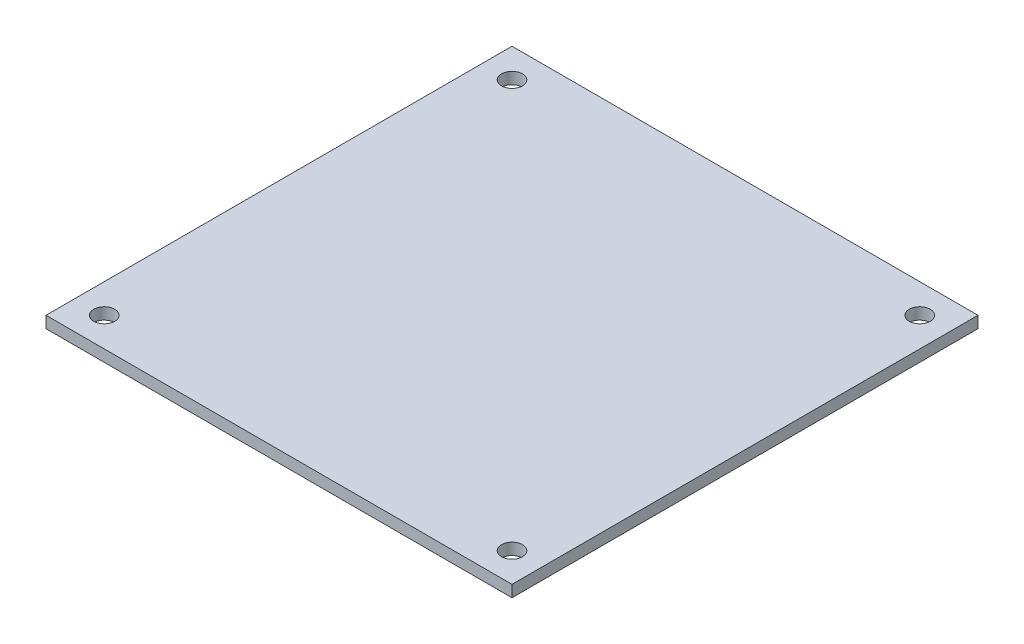
ISO-10303-21;
HEADER;
FILE_DESCRIPTION(('STEP AP214'),'2;1');
FILE_NAME('part.step','',(''),(''),'','','');
FILE_SCHEMA(('AUTOMOTIVE_DESIGN { 1 0 10303 214 1 1 1 1 }'));
ENDSEC;
DATA;
#1=APPLICATION_CONTEXT('core data for automotive mechanical design processes');
#2=APPLICATION_PROTOCOL_DEFINITION('international standard','automotive_design',2000,#1);
#3=PRODUCT_CONTEXT('',#1,'mechanical');
#4=PRODUCT('Part','Part','',(#3));
#5=PRODUCT_RELATED_PRODUCT_CATEGORY('part','',(#4));
#6=PRODUCT_DEFINITION_FORMATION('','',#4);
#7=PRODUCT_DEFINITION_CONTEXT('part definition',#1,'design');
#8=PRODUCT_DEFINITION('design','',#6,#7);
#9=PRODUCT_DEFINITION_SHAPE('','',#8);
#10=(LENGTH_UNIT() NAMED_UNIT(*) SI_UNIT(.MILLI.,.METRE.));
#11=(NAMED_UNIT(*) PLANE_ANGLE_UNIT() SI_UNIT($,.RADIAN.));
#12=(NAMED_UNIT(*) SI_UNIT($,.STERADIAN.) SOLID_ANGLE_UNIT());
#13=UNCERTAINTY_MEASURE_WITH_UNIT(LENGTH_MEASURE(1.E-05),#10,'distance_accuracy_value','');
#14=(GEOMETRIC_REPRESENTATION_CONTEXT(3) GLOBAL_UNCERTAINTY_ASSIGNED_CONTEXT((#13)) GLOBAL_UNIT_ASSIGNED_CONTEXT((#10,
#11,#12)) REPRESENTATION_CONTEXT('',''));
#15=CARTESIAN_POINT('',(0.,0.,0.));
#16=DIRECTION('',(0.,0.,1.));
#17=DIRECTION('',(1.,0.,0.));
#18=AXIS2_PLACEMENT_3D('',#15,#16,#17);
#19=CARTESIAN_POINT('',(0.,2.,0.));
#20=DIRECTION('',(1.,0.,0.));
#21=DIRECTION('',(0.,0.,-1.));
#22=AXIS2_PLACEMENT_3D('',#19,#20,#21);
#23=PLANE('',#22);
#24=DIRECTION('',(0.,0.,1.));
#25=VECTOR('',#24,1.);
#26=CARTESIAN_POINT('',(0.,0.,0.));
#27=LINE('',#26,#25);
#28=CARTESIAN_POINT('',(0.,0.,-80.));
#29=VERTEX_POINT('',#28);
#30=CARTESIAN_POINT('',(0.,0.,0.));
#31=VERTEX_POINT('',#30);
#32=EDGE_CURVE('E102',#29,#31,#27,.T.);
#33=ORIENTED_EDGE('',*,*,#32,.T.);
#34=DIRECTION('',(0.,-1.,0.));
#35=VECTOR('',#34,1.);
#36=CARTESIAN_POINT('',(0.,2.,0.));
#37=LINE('',#36,#35);
#38=CARTESIAN_POINT('',(0.,2.,0.));
#39=VERTEX_POINT('',#38);
#40=EDGE_CURVE('E93',#39,#31,#37,.T.);
#41=ORIENTED_EDGE('',*,*,#40,.F.);
#42=DIRECTION('',(0.,0.,1.));
#43=VECTOR('',#42,1.);
#44=CARTESIAN_POINT('',(0.,2.,0.));
#45=LINE('',#44,#43);
#46=CARTESIAN_POINT('',(0.,2.,-80.));
#47=VERTEX_POINT('',#46);
#48=EDGE_CURVE('E87',#47,#39,#45,.T.);
#49=ORIENTED_EDGE('',*,*,#48,.F.);
#50=DIRECTION('',(0.,-1.,0.));
#51=VECTOR('',#50,1.);
#52=CARTESIAN_POINT('',(0.,2.,-80.));
#53=LINE('',#52,#51);
#54=EDGE_CURVE('E98',#47,#29,#53,.T.);
#55=ORIENTED_EDGE('',*,*,#54,.T.);
#56=EDGE_LOOP('',(#33,#41,#49,#55));
#57=FACE_BOUND('',#56,.T.);
#58=ADVANCED_FACE('F33',(#57),#23,.F.);
#59=CARTESIAN_POINT('',(0.,2.,0.));
#60=DIRECTION('',(0.,0.,-1.));
#61=DIRECTION('',(-1.,0.,0.));
#62=AXIS2_PLACEMENT_3D('',#59,#60,#61);
#63=PLANE('',#62);
#64=DIRECTION('',(1.,0.,0.));
#65=VECTOR('',#64,1.);
#66=CARTESIAN_POINT('',(0.,0.,0.));
#67=LINE('',#66,#65);
#68=CARTESIAN_POINT('',(80.,0.,0.));
#69=VERTEX_POINT('',#68);
#70=EDGE_CURVE('E92',#31,#69,#67,.T.);
#71=ORIENTED_EDGE('',*,*,#70,.T.);
#72=DIRECTION('',(0.,-1.,0.));
#73=VECTOR('',#72,1.);
#74=CARTESIAN_POINT('',(80.,2.,0.));
#75=LINE('',#74,#73);
#76=CARTESIAN_POINT('',(80.,2.,0.));
#77=VERTEX_POINT('',#76);
#78=EDGE_CURVE('E90',#77,#69,#75,.T.);
#79=ORIENTED_EDGE('',*,*,#78,.F.);
#80=DIRECTION('',(1.,0.,0.));
#81=VECTOR('',#80,1.);
#82=CARTESIAN_POINT('',(0.,2.,0.));
#83=LINE('',#82,#81);
#84=EDGE_CURVE('E81',#39,#77,#83,.T.);
#85=ORIENTED_EDGE('',*,*,#84,.F.);
#86=ORIENTED_EDGE('',*,*,#40,.T.);
#87=EDGE_LOOP('',(#71,#79,#85,#86));
#88=FACE_BOUND('',#87,.T.);
#89=ADVANCED_FACE('F91',(#88),#63,.F.);
#90=CARTESIAN_POINT('',(80.,2.,0.));
#91=DIRECTION('',(-1.,0.,0.));
#92=DIRECTION('',(0.,0.,1.));
#93=AXIS2_PLACEMENT_3D('',#90,#91,#92);
#94=PLANE('',#93);
#95=DIRECTION('',(0.,0.,-1.));
#96=VECTOR('',#95,1.);
#97=CARTESIAN_POINT('',(80.,0.,0.));
#98=LINE('',#97,#96);
#99=CARTESIAN_POINT('',(80.,0.,-80.));
#100=VERTEX_POINT('',#99);
#101=EDGE_CURVE('E67',#69,#100,#98,.T.);
#102=ORIENTED_EDGE('',*,*,#101,.T.);
#103=DIRECTION('',(0.,-1.,0.));
#104=VECTOR('',#103,1.);
#105=CARTESIAN_POINT('',(80.,2.,-80.));
#106=LINE('',#105,#104);
#107=CARTESIAN_POINT('',(80.,2.,-80.));
#108=VERTEX_POINT('',#107);
#109=EDGE_CURVE('E94',#108,#100,#106,.T.);
#110=ORIENTED_EDGE('',*,*,#109,.F.);
#111=DIRECTION('',(0.,0.,-1.));
#112=VECTOR('',#111,1.);
#113=CARTESIAN_POINT('',(80.,2.,0.));
#114=LINE('',#113,#112);
#115=EDGE_CURVE('E85',#77,#108,#114,.T.);
#116=ORIENTED_EDGE('',*,*,#115,.F.);
#117=ORIENTED_EDGE('',*,*,#78,.T.);
#118=EDGE_LOOP('',(#102,#110,#116,#117));
#119=FACE_BOUND('',#118,.T.);
#120=ADVANCED_FACE('F96',(#119),#94,.F.);
#121=CARTESIAN_POINT('',(0.,2.,-80.));
#122=DIRECTION('',(0.,0.,1.));
#123=DIRECTION('',(1.,0.,0.));
#124=AXIS2_PLACEMENT_3D('',#121,#122,#123);
#125=PLANE('',#124);
#126=DIRECTION('',(-1.,0.,0.));
#127=VECTOR('',#126,1.);
#128=CARTESIAN_POINT('',(0.,0.,-80.));
#129=LINE('',#128,#127);
#130=EDGE_CURVE('E73',#100,#29,#129,.T.);
#131=ORIENTED_EDGE('',*,*,#130,.T.);
#132=ORIENTED_EDGE('',*,*,#54,.F.);
#133=DIRECTION('',(-1.,0.,0.));
#134=VECTOR('',#133,1.);
#135=CARTESIAN_POINT('',(0.,2.,-80.));
#136=LINE('',#135,#134);
#137=EDGE_CURVE('E50',#108,#47,#136,.T.);
#138=ORIENTED_EDGE('',*,*,#137,.F.);
#139=ORIENTED_EDGE('',*,*,#109,.T.);
#140=EDGE_LOOP('',(#131,#132,#138,#139));
#141=FACE_BOUND('',#140,.T.);
#142=ADVANCED_FACE('F128',(#141),#125,.F.);
#143=CARTESIAN_POINT('',(0.,2.,0.));
#144=DIRECTION('',(0.,-1.,0.));
#145=DIRECTION('',(0.,0.,-1.));
#146=AXIS2_PLACEMENT_3D('',#143,#144,#145);
#147=PLANE('',#146);
#148=CARTESIAN_POINT('',(75.,2.,-75.));
#149=DIRECTION('',(0.,1.,0.));
#150=DIRECTION('',(0.,0.,1.));
#151=AXIS2_PLACEMENT_3D('',#148,#149,#150);
#152=CIRCLE('',#151,1.8);
#153=CARTESIAN_POINT('',(75.,2.,-73.2));
#154=VERTEX_POINT('',#153);
#155=EDGE_CURVE('E171',#154,#154,#152,.T.);
#156=ORIENTED_EDGE('',*,*,#155,.F.);
#157=EDGE_LOOP('',(#156));
#158=FACE_BOUND('',#157,.T.);
#159=CARTESIAN_POINT('',(5.,2.,-75.));
#160=DIRECTION('',(0.,1.,0.));
#161=DIRECTION('',(0.,0.,1.));
#162=AXIS2_PLACEMENT_3D('',#159,#160,#161);
#163=CIRCLE('',#162,1.8);
#164=CARTESIAN_POINT('',(5.,2.,-73.2));
#165=VERTEX_POINT('',#164);
#166=EDGE_CURVE('E172',#165,#165,#163,.T.);
#167=ORIENTED_EDGE('',*,*,#166,.F.);
#168=EDGE_LOOP('',(#167));
#169=FACE_BOUND('',#168,.T.);
#170=ORIENTED_EDGE('',*,*,#48,.T.);
#171=ORIENTED_EDGE('',*,*,#84,.T.);
#172=ORIENTED_EDGE('',*,*,#115,.T.);
#173=ORIENTED_EDGE('',*,*,#137,.T.);
#174=EDGE_LOOP('',(#170,#171,#172,#173));
#175=FACE_BOUND('',#174,.T.);
#176=CARTESIAN_POINT('',(5.,2.,-4.99999999999999));
#177=DIRECTION('',(0.,1.,0.));
#178=DIRECTION('',(0.,0.,1.));
#179=AXIS2_PLACEMENT_3D('',#176,#177,#178);
#180=CIRCLE('',#179,1.8);
#181=CARTESIAN_POINT('',(5.,2.,-3.19999999999999));
#182=VERTEX_POINT('',#181);
#183=EDGE_CURVE('E115',#182,#182,#180,.T.);
#184=ORIENTED_EDGE('',*,*,#183,.F.);
#185=EDGE_LOOP('',(#184));
#186=FACE_BOUND('',#185,.T.);
#187=CARTESIAN_POINT('',(75.,2.,-4.99999999999999));
#188=DIRECTION('',(0.,1.,0.));
#189=DIRECTION('',(0.,0.,1.));
#190=AXIS2_PLACEMENT_3D('',#187,#188,#189);
#191=CIRCLE('',#190,1.8);
#192=CARTESIAN_POINT('',(75.,2.,-3.19999999999999));
#193=VERTEX_POINT('',#192);
#194=EDGE_CURVE('E11',#193,#193,#191,.T.);
#195=ORIENTED_EDGE('',*,*,#194,.F.);
#196=EDGE_LOOP('',(#195));
#197=FACE_BOUND('',#196,.T.);
#198=ADVANCED_FACE('F82',(#158,#169,#175,#186,#197),#147,.F.);
#199=CARTESIAN_POINT('',(0.,0.,0.));
#200=DIRECTION('',(0.,-1.,0.));
#201=DIRECTION('',(0.,0.,-1.));
#202=AXIS2_PLACEMENT_3D('',#199,#200,#201);
#203=PLANE('',#202);
#204=CARTESIAN_POINT('',(75.,0.,-75.));
#205=DIRECTION('',(0.,1.,0.));
#206=DIRECTION('',(0.,0.,1.));
#207=AXIS2_PLACEMENT_3D('',#204,#205,#206);
#208=CIRCLE('',#207,1.8);
#209=CARTESIAN_POINT('',(75.,0.,-73.2));
#210=VERTEX_POINT('',#209);
#211=EDGE_CURVE('E169',#210,#210,#208,.T.);
#212=ORIENTED_EDGE('',*,*,#211,.T.);
#213=EDGE_LOOP('',(#212));
#214=FACE_BOUND('',#213,.T.);
#215=CARTESIAN_POINT('',(5.,0.,-75.));
#216=DIRECTION('',(0.,1.,0.));
#217=DIRECTION('',(0.,0.,1.));
#218=AXIS2_PLACEMENT_3D('',#215,#216,#217);
#219=CIRCLE('',#218,1.8);
#220=CARTESIAN_POINT('',(5.,0.,-73.2));
#221=VERTEX_POINT('',#220);
#222=EDGE_CURVE('E105',#221,#221,#219,.T.);
#223=ORIENTED_EDGE('',*,*,#222,.T.);
#224=EDGE_LOOP('',(#223));
#225=FACE_BOUND('',#224,.T.);
#226=ORIENTED_EDGE('',*,*,#32,.F.);
#227=ORIENTED_EDGE('',*,*,#130,.F.);
#228=ORIENTED_EDGE('',*,*,#101,.F.);
#229=ORIENTED_EDGE('',*,*,#70,.F.);
#230=EDGE_LOOP('',(#226,#227,#228,#229));
#231=FACE_BOUND('',#230,.T.);
#232=CARTESIAN_POINT('',(5.,0.,-4.99999999999999));
#233=DIRECTION('',(0.,1.,0.));
#234=DIRECTION('',(0.,0.,1.));
#235=AXIS2_PLACEMENT_3D('',#232,#233,#234);
#236=CIRCLE('',#235,1.8);
#237=CARTESIAN_POINT('',(5.,0.,-3.19999999999999));
#238=VERTEX_POINT('',#237);
#239=EDGE_CURVE('E112',#238,#238,#236,.T.);
#240=ORIENTED_EDGE('',*,*,#239,.T.);
#241=EDGE_LOOP('',(#240));
#242=FACE_BOUND('',#241,.T.);
#243=CARTESIAN_POINT('',(75.,0.,-4.99999999999999));
#244=DIRECTION('',(0.,1.,0.));
#245=DIRECTION('',(0.,0.,1.));
#246=AXIS2_PLACEMENT_3D('',#243,#244,#245);
#247=CIRCLE('',#246,1.8);
#248=CARTESIAN_POINT('',(75.,0.,-3.19999999999999));
#249=VERTEX_POINT('',#248);
#250=EDGE_CURVE('E42',#249,#249,#247,.T.);
#251=ORIENTED_EDGE('',*,*,#250,.T.);
#252=EDGE_LOOP('',(#251));
#253=FACE_BOUND('',#252,.T.);
#254=ADVANCED_FACE('F120',(#214,#225,#231,#242,#253),#203,.T.);
#255=CARTESIAN_POINT('',(5.,0.,-75.));
#256=DIRECTION('',(0.,1.,0.));
#257=DIRECTION('',(0.,0.,1.));
#258=AXIS2_PLACEMENT_3D('',#255,#256,#257);
#259=CYLINDRICAL_SURFACE('',#258,1.8);
#260=ORIENTED_EDGE('',*,*,#222,.F.);
#261=EDGE_LOOP('',(#260));
#262=FACE_BOUND('',#261,.T.);
#263=ORIENTED_EDGE('',*,*,#166,.T.);
#264=EDGE_LOOP('',(#263));
#265=FACE_BOUND('',#264,.T.);
#266=ADVANCED_FACE('F135',(#262,#265),#259,.F.);
#267=CARTESIAN_POINT('',(75.,0.,-75.));
#268=DIRECTION('',(0.,1.,0.));
#269=DIRECTION('',(0.,0.,1.));
#270=AXIS2_PLACEMENT_3D('',#267,#268,#269);
#271=CYLINDRICAL_SURFACE('',#270,1.8);
#272=ORIENTED_EDGE('',*,*,#211,.F.);
#273=EDGE_LOOP('',(#272));
#274=FACE_BOUND('',#273,.T.);
#275=ORIENTED_EDGE('',*,*,#155,.T.);
#276=EDGE_LOOP('',(#275));
#277=FACE_BOUND('',#276,.T.);
#278=ADVANCED_FACE('F151',(#274,#277),#271,.F.);
#279=CARTESIAN_POINT('',(5.,0.,-4.99999999999999));
#280=DIRECTION('',(0.,1.,0.));
#281=DIRECTION('',(0.,0.,1.));
#282=AXIS2_PLACEMENT_3D('',#279,#280,#281);
#283=CYLINDRICAL_SURFACE('',#282,1.8);
#284=ORIENTED_EDGE('',*,*,#239,.F.);
#285=EDGE_LOOP('',(#284));
#286=FACE_BOUND('',#285,.T.);
#287=ORIENTED_EDGE('',*,*,#183,.T.);
#288=EDGE_LOOP('',(#287));
#289=FACE_BOUND('',#288,.T.);
#290=ADVANCED_FACE('F124',(#286,#289),#283,.F.);
#291=CARTESIAN_POINT('',(75.,0.,-4.99999999999999));
#292=DIRECTION('',(0.,1.,0.));
#293=DIRECTION('',(0.,0.,1.));
#294=AXIS2_PLACEMENT_3D('',#291,#292,#293);
#295=CYLINDRICAL_SURFACE('',#294,1.8);
#296=ORIENTED_EDGE('',*,*,#250,.F.);
#297=EDGE_LOOP('',(#296));
#298=FACE_BOUND('',#297,.T.);
#299=ORIENTED_EDGE('',*,*,#194,.T.);
#300=EDGE_LOOP('',(#299));
#301=FACE_BOUND('',#300,.T.);
#302=ADVANCED_FACE('F35',(#298,#301),#295,.F.);
#303=CLOSED_SHELL('',(#58,#89,#120,#142,#198,#254,#266,#278,#290,#302));
#304=MANIFOLD_SOLID_BREP('B2',#303);
#305=ADVANCED_BREP_SHAPE_REPRESENTATION('',(#18,#304),#14);
#306=SHAPE_DEFINITION_REPRESENTATION(#9,#305);
ENDSEC;
END-ISO-10303-21;
